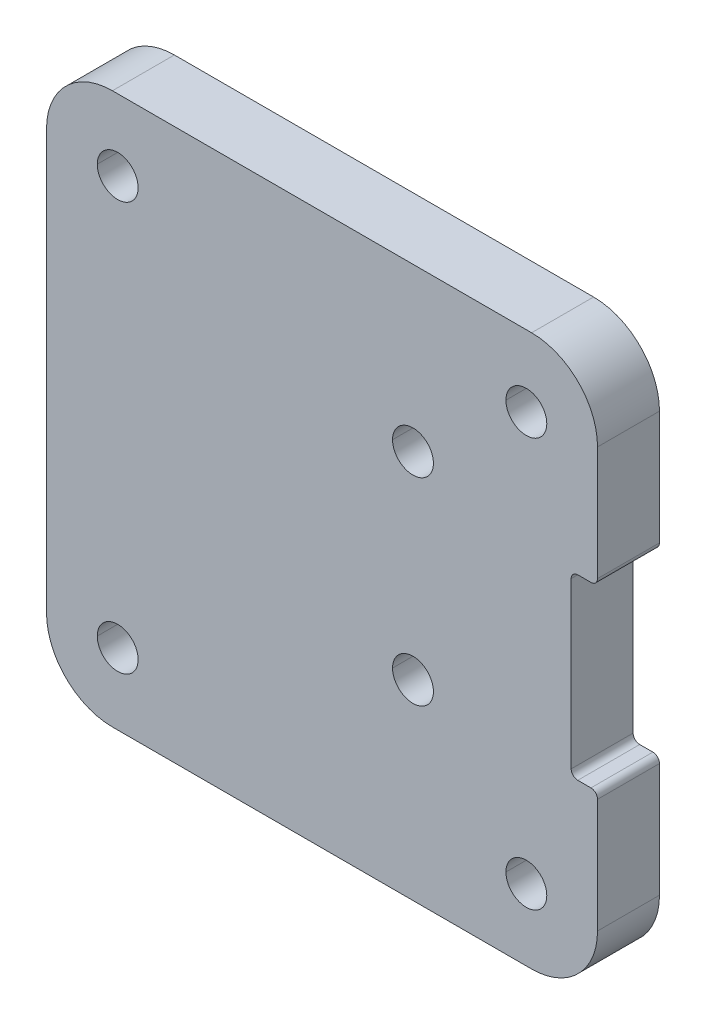
ISO-10303-21;
HEADER;
FILE_DESCRIPTION(('STEP AP214'),'2;1');
FILE_NAME('part.step','',(''),(''),'','','');
FILE_SCHEMA(('AUTOMOTIVE_DESIGN { 1 0 10303 214 1 1 1 1 }'));
ENDSEC;
DATA;
#1=APPLICATION_CONTEXT('core data for automotive mechanical design processes');
#2=APPLICATION_PROTOCOL_DEFINITION('international standard','automotive_design',2000,#1);
#3=PRODUCT_CONTEXT('',#1,'mechanical');
#4=PRODUCT('Part','Part','',(#3));
#5=PRODUCT_RELATED_PRODUCT_CATEGORY('part','',(#4));
#6=PRODUCT_DEFINITION_FORMATION('','',#4);
#7=PRODUCT_DEFINITION_CONTEXT('part definition',#1,'design');
#8=PRODUCT_DEFINITION('design','',#6,#7);
#9=PRODUCT_DEFINITION_SHAPE('','',#8);
#10=(LENGTH_UNIT() NAMED_UNIT(*) SI_UNIT(.MILLI.,.METRE.));
#11=(NAMED_UNIT(*) PLANE_ANGLE_UNIT() SI_UNIT($,.RADIAN.));
#12=(NAMED_UNIT(*) SI_UNIT($,.STERADIAN.) SOLID_ANGLE_UNIT());
#13=UNCERTAINTY_MEASURE_WITH_UNIT(LENGTH_MEASURE(1.E-05),#10,'distance_accuracy_value','');
#14=(GEOMETRIC_REPRESENTATION_CONTEXT(3) GLOBAL_UNCERTAINTY_ASSIGNED_CONTEXT((#13)) GLOBAL_UNIT_ASSIGNED_CONTEXT((#10,
#11,#12)) REPRESENTATION_CONTEXT('',''));
#15=CARTESIAN_POINT('',(0.,0.,0.));
#16=DIRECTION('',(0.,0.,1.));
#17=DIRECTION('',(1.,0.,0.));
#18=AXIS2_PLACEMENT_3D('',#15,#16,#17);
#19=CARTESIAN_POINT('',(20.4,7.25,4.7));
#20=DIRECTION('',(0.,0.,-1.));
#21=DIRECTION('',(-1.,0.,0.));
#22=AXIS2_PLACEMENT_3D('',#19,#20,#21);
#23=CYLINDRICAL_SURFACE('',#22,0.5);
#24=CARTESIAN_POINT('',(20.4,7.25,4.7));
#25=DIRECTION('',(0.,0.,1.));
#26=DIRECTION('',(-1.,0.,0.));
#27=AXIS2_PLACEMENT_3D('',#24,#25,#26);
#28=CIRCLE('',#27,0.5);
#29=CARTESIAN_POINT('',(20.4,6.75,4.7));
#30=VERTEX_POINT('',#29);
#31=CARTESIAN_POINT('',(20.9,7.25,4.7));
#32=VERTEX_POINT('',#31);
#33=EDGE_CURVE('E392',#30,#32,#28,.T.);
#34=ORIENTED_EDGE('',*,*,#33,.F.);
#35=DIRECTION('',(0.,0.,1.));
#36=VECTOR('',#35,1.);
#37=CARTESIAN_POINT('',(20.4,6.75,4.7));
#38=LINE('',#37,#36);
#39=CARTESIAN_POINT('',(20.4,6.75,0.));
#40=VERTEX_POINT('',#39);
#41=EDGE_CURVE('E495',#40,#30,#38,.T.);
#42=ORIENTED_EDGE('',*,*,#41,.F.);
#43=CARTESIAN_POINT('',(20.4,7.25,0.));
#44=DIRECTION('',(0.,0.,-1.));
#45=DIRECTION('',(-1.,0.,0.));
#46=AXIS2_PLACEMENT_3D('',#43,#44,#45);
#47=CIRCLE('',#46,0.5);
#48=CARTESIAN_POINT('',(20.9,7.25,0.));
#49=VERTEX_POINT('',#48);
#50=EDGE_CURVE('E405',#49,#40,#47,.T.);
#51=ORIENTED_EDGE('',*,*,#50,.F.);
#52=DIRECTION('',(0.,0.,-1.));
#53=VECTOR('',#52,1.);
#54=CARTESIAN_POINT('',(20.9,7.25,4.7));
#55=LINE('',#54,#53);
#56=EDGE_CURVE('E491',#32,#49,#55,.T.);
#57=ORIENTED_EDGE('',*,*,#56,.F.);
#58=EDGE_LOOP('',(#34,#42,#51,#57));
#59=FACE_BOUND('',#58,.T.);
#60=ADVANCED_FACE('F17',(#59),#23,.T.);
#61=CARTESIAN_POINT('',(19.4,6.25,4.7));
#62=DIRECTION('',(0.,0.,1.));
#63=DIRECTION('',(1.,0.,0.));
#64=AXIS2_PLACEMENT_3D('',#61,#62,#63);
#65=CYLINDRICAL_SURFACE('',#64,0.5);
#66=CARTESIAN_POINT('',(19.4,6.25,4.7));
#67=DIRECTION('',(0.,0.,-1.));
#68=DIRECTION('',(-1.,0.,0.));
#69=AXIS2_PLACEMENT_3D('',#66,#67,#68);
#70=CIRCLE('',#69,0.5);
#71=CARTESIAN_POINT('',(18.9,6.25,4.7));
#72=VERTEX_POINT('',#71);
#73=CARTESIAN_POINT('',(19.4,6.75,4.7));
#74=VERTEX_POINT('',#73);
#75=EDGE_CURVE('E384',#72,#74,#70,.T.);
#76=ORIENTED_EDGE('',*,*,#75,.F.);
#77=DIRECTION('',(0.,0.,1.));
#78=VECTOR('',#77,1.);
#79=CARTESIAN_POINT('',(18.9,6.25,4.7));
#80=LINE('',#79,#78);
#81=CARTESIAN_POINT('',(18.9,6.25,0.));
#82=VERTEX_POINT('',#81);
#83=EDGE_CURVE('E50',#82,#72,#80,.T.);
#84=ORIENTED_EDGE('',*,*,#83,.F.);
#85=CARTESIAN_POINT('',(19.4,6.25,0.));
#86=DIRECTION('',(0.,0.,1.));
#87=DIRECTION('',(-1.,0.,0.));
#88=AXIS2_PLACEMENT_3D('',#85,#86,#87);
#89=CIRCLE('',#88,0.5);
#90=CARTESIAN_POINT('',(19.4,6.75,0.));
#91=VERTEX_POINT('',#90);
#92=EDGE_CURVE('E503',#91,#82,#89,.T.);
#93=ORIENTED_EDGE('',*,*,#92,.F.);
#94=DIRECTION('',(0.,0.,-1.));
#95=VECTOR('',#94,1.);
#96=CARTESIAN_POINT('',(19.4,6.75,0.));
#97=LINE('',#96,#95);
#98=EDGE_CURVE('E524',#74,#91,#97,.T.);
#99=ORIENTED_EDGE('',*,*,#98,.F.);
#100=EDGE_LOOP('',(#76,#84,#93,#99));
#101=FACE_BOUND('',#100,.T.);
#102=ADVANCED_FACE('F568',(#101),#65,.F.);
#103=CARTESIAN_POINT('',(19.4,-6.25,4.7));
#104=DIRECTION('',(0.,0.,1.));
#105=DIRECTION('',(1.,0.,0.));
#106=AXIS2_PLACEMENT_3D('',#103,#104,#105);
#107=CYLINDRICAL_SURFACE('',#106,0.5);
#108=CARTESIAN_POINT('',(19.4,-6.25,4.7));
#109=DIRECTION('',(0.,0.,-1.));
#110=DIRECTION('',(-1.,0.,0.));
#111=AXIS2_PLACEMENT_3D('',#108,#109,#110);
#112=CIRCLE('',#111,0.5);
#113=CARTESIAN_POINT('',(19.4,-6.75,4.7));
#114=VERTEX_POINT('',#113);
#115=CARTESIAN_POINT('',(18.9,-6.25,4.7));
#116=VERTEX_POINT('',#115);
#117=EDGE_CURVE('E367',#114,#116,#112,.T.);
#118=ORIENTED_EDGE('',*,*,#117,.F.);
#119=DIRECTION('',(0.,0.,1.));
#120=VECTOR('',#119,1.);
#121=CARTESIAN_POINT('',(19.4,-6.75,4.7));
#122=LINE('',#121,#120);
#123=CARTESIAN_POINT('',(19.4,-6.75,0.));
#124=VERTEX_POINT('',#123);
#125=EDGE_CURVE('E482',#124,#114,#122,.T.);
#126=ORIENTED_EDGE('',*,*,#125,.F.);
#127=CARTESIAN_POINT('',(19.4,-6.25,0.));
#128=DIRECTION('',(0.,0.,1.));
#129=DIRECTION('',(-1.,0.,0.));
#130=AXIS2_PLACEMENT_3D('',#127,#128,#129);
#131=CIRCLE('',#130,0.5);
#132=CARTESIAN_POINT('',(18.9,-6.25,0.));
#133=VERTEX_POINT('',#132);
#134=EDGE_CURVE('E465',#133,#124,#131,.T.);
#135=ORIENTED_EDGE('',*,*,#134,.F.);
#136=DIRECTION('',(0.,0.,-1.));
#137=VECTOR('',#136,1.);
#138=CARTESIAN_POINT('',(18.9,-6.25,0.));
#139=LINE('',#138,#137);
#140=EDGE_CURVE('E39',#116,#133,#139,.T.);
#141=ORIENTED_EDGE('',*,*,#140,.F.);
#142=EDGE_LOOP('',(#118,#126,#135,#141));
#143=FACE_BOUND('',#142,.T.);
#144=ADVANCED_FACE('F570',(#143),#107,.F.);
#145=CARTESIAN_POINT('',(20.4,-7.25,4.7));
#146=DIRECTION('',(0.,0.,-1.));
#147=DIRECTION('',(-1.,0.,0.));
#148=AXIS2_PLACEMENT_3D('',#145,#146,#147);
#149=CYLINDRICAL_SURFACE('',#148,0.5);
#150=CARTESIAN_POINT('',(20.4,-7.25,4.7));
#151=DIRECTION('',(0.,0.,1.));
#152=DIRECTION('',(-1.,0.,0.));
#153=AXIS2_PLACEMENT_3D('',#150,#151,#152);
#154=CIRCLE('',#153,0.5);
#155=CARTESIAN_POINT('',(20.9,-7.25,4.7));
#156=VERTEX_POINT('',#155);
#157=CARTESIAN_POINT('',(20.4,-6.75,4.7));
#158=VERTEX_POINT('',#157);
#159=EDGE_CURVE('E362',#156,#158,#154,.T.);
#160=ORIENTED_EDGE('',*,*,#159,.F.);
#161=DIRECTION('',(0.,0.,1.));
#162=VECTOR('',#161,1.);
#163=CARTESIAN_POINT('',(20.9,-7.25,4.7));
#164=LINE('',#163,#162);
#165=CARTESIAN_POINT('',(20.9,-7.25,0.));
#166=VERTEX_POINT('',#165);
#167=EDGE_CURVE('E517',#166,#156,#164,.T.);
#168=ORIENTED_EDGE('',*,*,#167,.F.);
#169=CARTESIAN_POINT('',(20.4,-7.25,0.));
#170=DIRECTION('',(0.,0.,-1.));
#171=DIRECTION('',(-1.,0.,0.));
#172=AXIS2_PLACEMENT_3D('',#169,#170,#171);
#173=CIRCLE('',#172,0.5);
#174=CARTESIAN_POINT('',(20.4,-6.75,0.));
#175=VERTEX_POINT('',#174);
#176=EDGE_CURVE('E460',#175,#166,#173,.T.);
#177=ORIENTED_EDGE('',*,*,#176,.F.);
#178=DIRECTION('',(0.,0.,-1.));
#179=VECTOR('',#178,1.);
#180=CARTESIAN_POINT('',(20.4,-6.75,4.7));
#181=LINE('',#180,#179);
#182=EDGE_CURVE('E523',#158,#175,#181,.T.);
#183=ORIENTED_EDGE('',*,*,#182,.F.);
#184=EDGE_LOOP('',(#160,#168,#177,#183));
#185=FACE_BOUND('',#184,.T.);
#186=ADVANCED_FACE('F576',(#185),#149,.T.);
#187=CARTESIAN_POINT('',(-15.9,15.9,4.7));
#188=DIRECTION('',(0.,0.,-1.));
#189=DIRECTION('',(-1.,0.,0.));
#190=AXIS2_PLACEMENT_3D('',#187,#188,#189);
#191=CYLINDRICAL_SURFACE('',#190,5.);
#192=CARTESIAN_POINT('',(-15.9,15.9,4.7));
#193=DIRECTION('',(0.,0.,1.));
#194=DIRECTION('',(-1.,0.,0.));
#195=AXIS2_PLACEMENT_3D('',#192,#193,#194);
#196=CIRCLE('',#195,5.);
#197=CARTESIAN_POINT('',(-15.9,20.9,4.7));
#198=VERTEX_POINT('',#197);
#199=CARTESIAN_POINT('',(-20.9,15.9,4.7));
#200=VERTEX_POINT('',#199);
#201=EDGE_CURVE('E349',#198,#200,#196,.T.);
#202=ORIENTED_EDGE('',*,*,#201,.F.);
#203=DIRECTION('',(0.,0.,1.));
#204=VECTOR('',#203,1.);
#205=CARTESIAN_POINT('',(-15.9,20.9,4.7));
#206=LINE('',#205,#204);
#207=CARTESIAN_POINT('',(-15.9,20.9,0.));
#208=VERTEX_POINT('',#207);
#209=EDGE_CURVE('E11',#208,#198,#206,.T.);
#210=ORIENTED_EDGE('',*,*,#209,.F.);
#211=CARTESIAN_POINT('',(-15.9,15.9,0.));
#212=DIRECTION('',(0.,0.,-1.));
#213=DIRECTION('',(-1.,0.,0.));
#214=AXIS2_PLACEMENT_3D('',#211,#212,#213);
#215=CIRCLE('',#214,5.);
#216=CARTESIAN_POINT('',(-20.9,15.9,0.));
#217=VERTEX_POINT('',#216);
#218=EDGE_CURVE('E379',#217,#208,#215,.T.);
#219=ORIENTED_EDGE('',*,*,#218,.F.);
#220=DIRECTION('',(0.,0.,-1.));
#221=VECTOR('',#220,1.);
#222=CARTESIAN_POINT('',(-20.9,15.9,4.7));
#223=LINE('',#222,#221);
#224=EDGE_CURVE('E308',#200,#217,#223,.T.);
#225=ORIENTED_EDGE('',*,*,#224,.F.);
#226=EDGE_LOOP('',(#202,#210,#219,#225));
#227=FACE_BOUND('',#226,.T.);
#228=ADVANCED_FACE('F555',(#227),#191,.T.);
#229=CARTESIAN_POINT('',(15.9,15.9,4.7));
#230=DIRECTION('',(0.,0.,-1.));
#231=DIRECTION('',(-1.,0.,0.));
#232=AXIS2_PLACEMENT_3D('',#229,#230,#231);
#233=CYLINDRICAL_SURFACE('',#232,5.);
#234=CARTESIAN_POINT('',(15.9,15.9,4.7));
#235=DIRECTION('',(0.,0.,1.));
#236=DIRECTION('',(-1.,0.,0.));
#237=AXIS2_PLACEMENT_3D('',#234,#235,#236);
#238=CIRCLE('',#237,5.);
#239=CARTESIAN_POINT('',(20.9,15.9,4.7));
#240=VERTEX_POINT('',#239);
#241=CARTESIAN_POINT('',(15.9,20.9,4.7));
#242=VERTEX_POINT('',#241);
#243=EDGE_CURVE('E413',#240,#242,#238,.T.);
#244=ORIENTED_EDGE('',*,*,#243,.F.);
#245=DIRECTION('',(0.,0.,1.));
#246=VECTOR('',#245,1.);
#247=CARTESIAN_POINT('',(20.9,15.9,4.7));
#248=LINE('',#247,#246);
#249=CARTESIAN_POINT('',(20.9,15.9,0.));
#250=VERTEX_POINT('',#249);
#251=EDGE_CURVE('E494',#250,#240,#248,.T.);
#252=ORIENTED_EDGE('',*,*,#251,.F.);
#253=CARTESIAN_POINT('',(15.9,15.9,0.));
#254=DIRECTION('',(0.,0.,-1.));
#255=DIRECTION('',(-1.,0.,0.));
#256=AXIS2_PLACEMENT_3D('',#253,#254,#255);
#257=CIRCLE('',#256,5.);
#258=CARTESIAN_POINT('',(15.9,20.9,0.));
#259=VERTEX_POINT('',#258);
#260=EDGE_CURVE('E406',#259,#250,#257,.T.);
#261=ORIENTED_EDGE('',*,*,#260,.F.);
#262=DIRECTION('',(0.,0.,-1.));
#263=VECTOR('',#262,1.);
#264=CARTESIAN_POINT('',(15.9,20.9,4.7));
#265=LINE('',#264,#263);
#266=EDGE_CURVE('E20',#242,#259,#265,.T.);
#267=ORIENTED_EDGE('',*,*,#266,.F.);
#268=EDGE_LOOP('',(#244,#252,#261,#267));
#269=FACE_BOUND('',#268,.T.);
#270=ADVANCED_FACE('F547',(#269),#233,.T.);
#271=CARTESIAN_POINT('',(15.9,-15.9,4.7));
#272=DIRECTION('',(0.,0.,-1.));
#273=DIRECTION('',(-1.,0.,0.));
#274=AXIS2_PLACEMENT_3D('',#271,#272,#273);
#275=CYLINDRICAL_SURFACE('',#274,5.);
#276=CARTESIAN_POINT('',(15.9,-15.9,4.7));
#277=DIRECTION('',(0.,0.,1.));
#278=DIRECTION('',(-1.,0.,0.));
#279=AXIS2_PLACEMENT_3D('',#276,#277,#278);
#280=CIRCLE('',#279,5.);
#281=CARTESIAN_POINT('',(15.9,-20.9,4.7));
#282=VERTEX_POINT('',#281);
#283=CARTESIAN_POINT('',(20.9,-15.9,4.7));
#284=VERTEX_POINT('',#283);
#285=EDGE_CURVE('E409',#282,#284,#280,.T.);
#286=ORIENTED_EDGE('',*,*,#285,.F.);
#287=DIRECTION('',(0.,0.,1.));
#288=VECTOR('',#287,1.);
#289=CARTESIAN_POINT('',(15.9,-20.9,4.7));
#290=LINE('',#289,#288);
#291=CARTESIAN_POINT('',(15.9,-20.9,0.));
#292=VERTEX_POINT('',#291);
#293=EDGE_CURVE('E307',#292,#282,#290,.T.);
#294=ORIENTED_EDGE('',*,*,#293,.F.);
#295=CARTESIAN_POINT('',(15.9,-15.9,0.));
#296=DIRECTION('',(0.,0.,-1.));
#297=DIRECTION('',(-1.,0.,0.));
#298=AXIS2_PLACEMENT_3D('',#295,#296,#297);
#299=CIRCLE('',#298,5.);
#300=CARTESIAN_POINT('',(20.9,-15.9,0.));
#301=VERTEX_POINT('',#300);
#302=EDGE_CURVE('E473',#301,#292,#299,.T.);
#303=ORIENTED_EDGE('',*,*,#302,.F.);
#304=DIRECTION('',(0.,0.,-1.));
#305=VECTOR('',#304,1.);
#306=CARTESIAN_POINT('',(20.9,-15.9,4.7));
#307=LINE('',#306,#305);
#308=EDGE_CURVE('E520',#284,#301,#307,.T.);
#309=ORIENTED_EDGE('',*,*,#308,.F.);
#310=EDGE_LOOP('',(#286,#294,#303,#309));
#311=FACE_BOUND('',#310,.T.);
#312=ADVANCED_FACE('F584',(#311),#275,.T.);
#313=CARTESIAN_POINT('',(-15.9,-15.9,4.7));
#314=DIRECTION('',(0.,0.,-1.));
#315=DIRECTION('',(-1.,0.,0.));
#316=AXIS2_PLACEMENT_3D('',#313,#314,#315);
#317=CYLINDRICAL_SURFACE('',#316,5.);
#318=CARTESIAN_POINT('',(-15.9,-15.9,4.7));
#319=DIRECTION('',(0.,0.,1.));
#320=DIRECTION('',(-1.,0.,0.));
#321=AXIS2_PLACEMENT_3D('',#318,#319,#320);
#322=CIRCLE('',#321,5.);
#323=CARTESIAN_POINT('',(-20.9,-15.9,4.7));
#324=VERTEX_POINT('',#323);
#325=CARTESIAN_POINT('',(-15.9,-20.9,4.7));
#326=VERTEX_POINT('',#325);
#327=EDGE_CURVE('E435',#324,#326,#322,.T.);
#328=ORIENTED_EDGE('',*,*,#327,.F.);
#329=DIRECTION('',(0.,0.,1.));
#330=VECTOR('',#329,1.);
#331=CARTESIAN_POINT('',(-20.9,-15.9,4.7));
#332=LINE('',#331,#330);
#333=CARTESIAN_POINT('',(-20.9,-15.9,0.));
#334=VERTEX_POINT('',#333);
#335=EDGE_CURVE('E325',#334,#324,#332,.T.);
#336=ORIENTED_EDGE('',*,*,#335,.F.);
#337=CARTESIAN_POINT('',(-15.9,-15.9,0.));
#338=DIRECTION('',(0.,0.,-1.));
#339=DIRECTION('',(-1.,0.,0.));
#340=AXIS2_PLACEMENT_3D('',#337,#338,#339);
#341=CIRCLE('',#340,5.);
#342=CARTESIAN_POINT('',(-15.9,-20.9,0.));
#343=VERTEX_POINT('',#342);
#344=EDGE_CURVE('E380',#343,#334,#341,.T.);
#345=ORIENTED_EDGE('',*,*,#344,.F.);
#346=DIRECTION('',(0.,0.,-1.));
#347=VECTOR('',#346,1.);
#348=CARTESIAN_POINT('',(-15.9,-20.9,4.7));
#349=LINE('',#348,#347);
#350=EDGE_CURVE('E304',#326,#343,#349,.T.);
#351=ORIENTED_EDGE('',*,*,#350,.F.);
#352=EDGE_LOOP('',(#328,#336,#345,#351));
#353=FACE_BOUND('',#352,.T.);
#354=ADVANCED_FACE('F589',(#353),#317,.T.);
#355=CARTESIAN_POINT('',(6.90000000000016,-6.4,4.7));
#356=DIRECTION('',(0.,0.,-1.));
#357=DIRECTION('',(-1.,0.,0.));
#358=AXIS2_PLACEMENT_3D('',#355,#356,#357);
#359=CYLINDRICAL_SURFACE('',#358,1.55);
#360=DIRECTION('',(0.,0.,-1.));
#361=VECTOR('',#360,1.);
#362=CARTESIAN_POINT('',(8.45000000000016,-6.4,4.7));
#363=LINE('',#362,#361);
#364=CARTESIAN_POINT('',(8.45000000000016,-6.4,4.7));
#365=VERTEX_POINT('',#364);
#366=CARTESIAN_POINT('',(8.45000000000016,-6.4,0.));
#367=VERTEX_POINT('',#366);
#368=EDGE_CURVE('E678',#365,#367,#363,.T.);
#369=ORIENTED_EDGE('',*,*,#368,.F.);
#370=CARTESIAN_POINT('',(6.90000000000016,-6.4,4.7));
#371=DIRECTION('',(0.,0.,1.));
#372=DIRECTION('',(1.,0.,0.));
#373=AXIS2_PLACEMENT_3D('',#370,#371,#372);
#374=CIRCLE('',#373,1.55);
#375=CARTESIAN_POINT('',(5.35000000000016,-6.4,4.7));
#376=VERTEX_POINT('',#375);
#377=EDGE_CURVE('E421',#365,#376,#374,.T.);
#378=ORIENTED_EDGE('',*,*,#377,.T.);
#379=DIRECTION('',(0.,0.,-1.));
#380=VECTOR('',#379,1.);
#381=CARTESIAN_POINT('',(5.35000000000016,-6.4,4.7));
#382=LINE('',#381,#380);
#383=CARTESIAN_POINT('',(5.35000000000016,-6.4,0.));
#384=VERTEX_POINT('',#383);
#385=EDGE_CURVE('E680',#376,#384,#382,.T.);
#386=ORIENTED_EDGE('',*,*,#385,.T.);
#387=CARTESIAN_POINT('',(6.90000000000016,-6.4,0.));
#388=DIRECTION('',(0.,0.,1.));
#389=DIRECTION('',(1.,0.,0.));
#390=AXIS2_PLACEMENT_3D('',#387,#388,#389);
#391=CIRCLE('',#390,1.55);
#392=EDGE_CURVE('E322',#367,#384,#391,.T.);
#393=ORIENTED_EDGE('',*,*,#392,.F.);
#394=EDGE_LOOP('',(#369,#378,#386,#393));
#395=FACE_BOUND('',#394,.T.);
#396=ADVANCED_FACE('F585',(#395),#359,.F.);
#397=CARTESIAN_POINT('',(6.9,8.6,4.7));
#398=DIRECTION('',(0.,0.,-1.));
#399=DIRECTION('',(-1.,0.,0.));
#400=AXIS2_PLACEMENT_3D('',#397,#398,#399);
#401=CYLINDRICAL_SURFACE('',#400,1.55);
#402=DIRECTION('',(0.,0.,-1.));
#403=VECTOR('',#402,1.);
#404=CARTESIAN_POINT('',(8.45,8.6,4.7));
#405=LINE('',#404,#403);
#406=CARTESIAN_POINT('',(8.45,8.6,4.7));
#407=VERTEX_POINT('',#406);
#408=CARTESIAN_POINT('',(8.45,8.6,0.));
#409=VERTEX_POINT('',#408);
#410=EDGE_CURVE('E703',#407,#409,#405,.T.);
#411=ORIENTED_EDGE('',*,*,#410,.F.);
#412=CARTESIAN_POINT('',(6.9,8.6,4.7));
#413=DIRECTION('',(0.,0.,1.));
#414=DIRECTION('',(1.,0.,0.));
#415=AXIS2_PLACEMENT_3D('',#412,#413,#414);
#416=CIRCLE('',#415,1.55);
#417=CARTESIAN_POINT('',(5.35,8.6,4.7));
#418=VERTEX_POINT('',#417);
#419=EDGE_CURVE('E425',#407,#418,#416,.T.);
#420=ORIENTED_EDGE('',*,*,#419,.T.);
#421=DIRECTION('',(0.,0.,-1.));
#422=VECTOR('',#421,1.);
#423=CARTESIAN_POINT('',(5.35,8.6,4.7));
#424=LINE('',#423,#422);
#425=CARTESIAN_POINT('',(5.35,8.6,0.));
#426=VERTEX_POINT('',#425);
#427=EDGE_CURVE('E695',#418,#426,#424,.T.);
#428=ORIENTED_EDGE('',*,*,#427,.T.);
#429=CARTESIAN_POINT('',(6.9,8.6,0.));
#430=DIRECTION('',(0.,0.,1.));
#431=DIRECTION('',(1.,0.,0.));
#432=AXIS2_PLACEMENT_3D('',#429,#430,#431);
#433=CIRCLE('',#432,1.55);
#434=EDGE_CURVE('E278',#409,#426,#433,.T.);
#435=ORIENTED_EDGE('',*,*,#434,.F.);
#436=EDGE_LOOP('',(#411,#420,#428,#435));
#437=FACE_BOUND('',#436,.T.);
#438=ADVANCED_FACE('F588',(#437),#401,.F.);
#439=CARTESIAN_POINT('',(-15.5000000000004,-15.5,4.7));
#440=DIRECTION('',(0.,0.,-1.));
#441=DIRECTION('',(-1.,0.,0.));
#442=AXIS2_PLACEMENT_3D('',#439,#440,#441);
#443=CYLINDRICAL_SURFACE('',#442,1.55);
#444=DIRECTION('',(0.,0.,-1.));
#445=VECTOR('',#444,1.);
#446=CARTESIAN_POINT('',(-13.9500000000004,-15.5,4.7));
#447=LINE('',#446,#445);
#448=CARTESIAN_POINT('',(-13.9500000000004,-15.5,4.7));
#449=VERTEX_POINT('',#448);
#450=CARTESIAN_POINT('',(-13.9500000000004,-15.5,0.));
#451=VERTEX_POINT('',#450);
#452=EDGE_CURVE('E692',#449,#451,#447,.T.);
#453=ORIENTED_EDGE('',*,*,#452,.F.);
#454=CARTESIAN_POINT('',(-15.5000000000004,-15.5,4.7));
#455=DIRECTION('',(0.,0.,1.));
#456=DIRECTION('',(-1.,0.,0.));
#457=AXIS2_PLACEMENT_3D('',#454,#455,#456);
#458=CIRCLE('',#457,1.55);
#459=CARTESIAN_POINT('',(-17.0500000000005,-15.5,4.7));
#460=VERTEX_POINT('',#459);
#461=EDGE_CURVE('E448',#449,#460,#458,.T.);
#462=ORIENTED_EDGE('',*,*,#461,.T.);
#463=DIRECTION('',(0.,0.,-1.));
#464=VECTOR('',#463,1.);
#465=CARTESIAN_POINT('',(-17.0500000000005,-15.5,4.7));
#466=LINE('',#465,#464);
#467=CARTESIAN_POINT('',(-17.0500000000005,-15.5,0.));
#468=VERTEX_POINT('',#467);
#469=EDGE_CURVE('E309',#460,#468,#466,.T.);
#470=ORIENTED_EDGE('',*,*,#469,.T.);
#471=CARTESIAN_POINT('',(-15.5000000000004,-15.5,0.));
#472=DIRECTION('',(0.,0.,1.));
#473=DIRECTION('',(-1.,0.,0.));
#474=AXIS2_PLACEMENT_3D('',#471,#472,#473);
#475=CIRCLE('',#474,1.55);
#476=EDGE_CURVE('E326',#451,#468,#475,.T.);
#477=ORIENTED_EDGE('',*,*,#476,.F.);
#478=EDGE_LOOP('',(#453,#462,#470,#477));
#479=FACE_BOUND('',#478,.T.);
#480=ADVANCED_FACE('F593',(#479),#443,.F.);
#481=CARTESIAN_POINT('',(15.4999999999994,-15.4999999999995,4.7));
#482=DIRECTION('',(0.,0.,-1.));
#483=DIRECTION('',(-1.,0.,0.));
#484=AXIS2_PLACEMENT_3D('',#481,#482,#483);
#485=CYLINDRICAL_SURFACE('',#484,1.55);
#486=DIRECTION('',(0.,0.,-1.));
#487=VECTOR('',#486,1.);
#488=CARTESIAN_POINT('',(17.0499999999994,-15.4999999999995,4.7));
#489=LINE('',#488,#487);
#490=CARTESIAN_POINT('',(17.0499999999994,-15.4999999999995,4.7));
#491=VERTEX_POINT('',#490);
#492=CARTESIAN_POINT('',(17.0499999999994,-15.4999999999995,0.));
#493=VERTEX_POINT('',#492);
#494=EDGE_CURVE('E291',#491,#493,#489,.T.);
#495=ORIENTED_EDGE('',*,*,#494,.F.);
#496=CARTESIAN_POINT('',(15.4999999999994,-15.4999999999995,4.7));
#497=DIRECTION('',(0.,0.,1.));
#498=DIRECTION('',(1.,0.,0.));
#499=AXIS2_PLACEMENT_3D('',#496,#497,#498);
#500=CIRCLE('',#499,1.55);
#501=CARTESIAN_POINT('',(13.9499999999994,-15.4999999999995,4.7));
#502=VERTEX_POINT('',#501);
#503=EDGE_CURVE('E283',#491,#502,#500,.T.);
#504=ORIENTED_EDGE('',*,*,#503,.T.);
#505=DIRECTION('',(0.,0.,-1.));
#506=VECTOR('',#505,1.);
#507=CARTESIAN_POINT('',(13.9499999999994,-15.4999999999995,4.7));
#508=LINE('',#507,#506);
#509=CARTESIAN_POINT('',(13.9499999999994,-15.4999999999995,0.));
#510=VERTEX_POINT('',#509);
#511=EDGE_CURVE('E281',#502,#510,#508,.T.);
#512=ORIENTED_EDGE('',*,*,#511,.T.);
#513=CARTESIAN_POINT('',(15.4999999999994,-15.4999999999995,0.));
#514=DIRECTION('',(0.,0.,1.));
#515=DIRECTION('',(1.,0.,0.));
#516=AXIS2_PLACEMENT_3D('',#513,#514,#515);
#517=CIRCLE('',#516,1.55);
#518=EDGE_CURVE('E267',#493,#510,#517,.T.);
#519=ORIENTED_EDGE('',*,*,#518,.F.);
#520=EDGE_LOOP('',(#495,#504,#512,#519));
#521=FACE_BOUND('',#520,.T.);
#522=ADVANCED_FACE('F282',(#521),#485,.F.);
#523=CARTESIAN_POINT('',(15.5,15.4999999999995,4.7));
#524=DIRECTION('',(0.,0.,-1.));
#525=DIRECTION('',(-1.,0.,0.));
#526=AXIS2_PLACEMENT_3D('',#523,#524,#525);
#527=CYLINDRICAL_SURFACE('',#526,1.55);
#528=DIRECTION('',(0.,0.,-1.));
#529=VECTOR('',#528,1.);
#530=CARTESIAN_POINT('',(17.05,15.4999999999995,4.7));
#531=LINE('',#530,#529);
#532=CARTESIAN_POINT('',(17.05,15.4999999999995,4.7));
#533=VERTEX_POINT('',#532);
#534=CARTESIAN_POINT('',(17.05,15.4999999999995,0.));
#535=VERTEX_POINT('',#534);
#536=EDGE_CURVE('E330',#533,#535,#531,.T.);
#537=ORIENTED_EDGE('',*,*,#536,.F.);
#538=CARTESIAN_POINT('',(15.5,15.4999999999995,4.7));
#539=DIRECTION('',(0.,0.,1.));
#540=DIRECTION('',(-1.,0.,0.));
#541=AXIS2_PLACEMENT_3D('',#538,#539,#540);
#542=CIRCLE('',#541,1.55);
#543=CARTESIAN_POINT('',(13.95,15.4999999999995,4.7));
#544=VERTEX_POINT('',#543);
#545=EDGE_CURVE('E393',#533,#544,#542,.T.);
#546=ORIENTED_EDGE('',*,*,#545,.T.);
#547=DIRECTION('',(0.,0.,-1.));
#548=VECTOR('',#547,1.);
#549=CARTESIAN_POINT('',(13.95,15.4999999999995,4.7));
#550=LINE('',#549,#548);
#551=CARTESIAN_POINT('',(13.95,15.4999999999995,0.));
#552=VERTEX_POINT('',#551);
#553=EDGE_CURVE('E338',#544,#552,#550,.T.);
#554=ORIENTED_EDGE('',*,*,#553,.T.);
#555=CARTESIAN_POINT('',(15.5,15.4999999999995,0.));
#556=DIRECTION('',(0.,0.,1.));
#557=DIRECTION('',(-1.,0.,0.));
#558=AXIS2_PLACEMENT_3D('',#555,#556,#557);
#559=CIRCLE('',#558,1.55);
#560=EDGE_CURVE('E431',#535,#552,#559,.T.);
#561=ORIENTED_EDGE('',*,*,#560,.F.);
#562=EDGE_LOOP('',(#537,#546,#554,#561));
#563=FACE_BOUND('',#562,.T.);
#564=ADVANCED_FACE('F600',(#563),#527,.F.);
#565=CARTESIAN_POINT('',(-15.5,15.5,4.7));
#566=DIRECTION('',(0.,0.,-1.));
#567=DIRECTION('',(-1.,0.,0.));
#568=AXIS2_PLACEMENT_3D('',#565,#566,#567);
#569=CYLINDRICAL_SURFACE('',#568,1.55);
#570=DIRECTION('',(0.,0.,-1.));
#571=VECTOR('',#570,1.);
#572=CARTESIAN_POINT('',(-13.95,15.5,4.7));
#573=LINE('',#572,#571);
#574=CARTESIAN_POINT('',(-13.95,15.5,4.7));
#575=VERTEX_POINT('',#574);
#576=CARTESIAN_POINT('',(-13.95,15.5,0.));
#577=VERTEX_POINT('',#576);
#578=EDGE_CURVE('E320',#575,#577,#573,.T.);
#579=ORIENTED_EDGE('',*,*,#578,.F.);
#580=CARTESIAN_POINT('',(-15.5,15.5,4.7));
#581=DIRECTION('',(0.,0.,1.));
#582=DIRECTION('',(1.,0.,0.));
#583=AXIS2_PLACEMENT_3D('',#580,#581,#582);
#584=CIRCLE('',#583,1.55);
#585=CARTESIAN_POINT('',(-17.05,15.5,4.7));
#586=VERTEX_POINT('',#585);
#587=EDGE_CURVE('E396',#575,#586,#584,.T.);
#588=ORIENTED_EDGE('',*,*,#587,.T.);
#589=DIRECTION('',(0.,0.,-1.));
#590=VECTOR('',#589,1.);
#591=CARTESIAN_POINT('',(-17.05,15.5,4.7));
#592=LINE('',#591,#590);
#593=CARTESIAN_POINT('',(-17.05,15.5,0.));
#594=VERTEX_POINT('',#593);
#595=EDGE_CURVE('E319',#586,#594,#592,.T.);
#596=ORIENTED_EDGE('',*,*,#595,.T.);
#597=CARTESIAN_POINT('',(-15.5,15.5,0.));
#598=DIRECTION('',(0.,0.,1.));
#599=DIRECTION('',(1.,0.,0.));
#600=AXIS2_PLACEMENT_3D('',#597,#598,#599);
#601=CIRCLE('',#600,1.55);
#602=EDGE_CURVE('E277',#577,#594,#601,.T.);
#603=ORIENTED_EDGE('',*,*,#602,.F.);
#604=EDGE_LOOP('',(#579,#588,#596,#603));
#605=FACE_BOUND('',#604,.T.);
#606=ADVANCED_FACE('F603',(#605),#569,.F.);
#607=CARTESIAN_POINT('',(20.9,20.9,4.7));
#608=DIRECTION('',(0.,-1.,0.));
#609=DIRECTION('',(0.,0.,-1.));
#610=AXIS2_PLACEMENT_3D('',#607,#608,#609);
#611=PLANE('',#610);
#612=DIRECTION('',(-1.,0.,0.));
#613=VECTOR('',#612,1.);
#614=CARTESIAN_POINT('',(20.9,20.9,4.7));
#615=LINE('',#614,#613);
#616=EDGE_CURVE('E354',#242,#198,#615,.T.);
#617=ORIENTED_EDGE('',*,*,#616,.F.);
#618=ORIENTED_EDGE('',*,*,#266,.T.);
#619=DIRECTION('',(-1.,0.,0.));
#620=VECTOR('',#619,1.);
#621=CARTESIAN_POINT('',(20.9,20.9,0.));
#622=LINE('',#621,#620);
#623=EDGE_CURVE('E420',#259,#208,#622,.T.);
#624=ORIENTED_EDGE('',*,*,#623,.T.);
#625=ORIENTED_EDGE('',*,*,#209,.T.);
#626=EDGE_LOOP('',(#617,#618,#624,#625));
#627=FACE_BOUND('',#626,.T.);
#628=ADVANCED_FACE('F544',(#627),#611,.F.);
#629=CARTESIAN_POINT('',(20.9,20.9,4.7));
#630=DIRECTION('',(-1.,0.,0.));
#631=DIRECTION('',(0.,1.,0.));
#632=AXIS2_PLACEMENT_3D('',#629,#630,#631);
#633=PLANE('',#632);
#634=DIRECTION('',(0.,1.,0.));
#635=VECTOR('',#634,1.);
#636=CARTESIAN_POINT('',(20.9,20.9,4.7));
#637=LINE('',#636,#635);
#638=EDGE_CURVE('E400',#32,#240,#637,.T.);
#639=ORIENTED_EDGE('',*,*,#638,.F.);
#640=ORIENTED_EDGE('',*,*,#56,.T.);
#641=DIRECTION('',(0.,1.,0.));
#642=VECTOR('',#641,1.);
#643=CARTESIAN_POINT('',(20.9,20.9,0.));
#644=LINE('',#643,#642);
#645=EDGE_CURVE('E401',#49,#250,#644,.T.);
#646=ORIENTED_EDGE('',*,*,#645,.T.);
#647=ORIENTED_EDGE('',*,*,#251,.T.);
#648=EDGE_LOOP('',(#639,#640,#646,#647));
#649=FACE_BOUND('',#648,.T.);
#650=ADVANCED_FACE('F560',(#649),#633,.F.);
#651=CARTESIAN_POINT('',(20.9,6.75,4.7));
#652=DIRECTION('',(0.,1.,0.));
#653=DIRECTION('',(1.,0.,0.));
#654=AXIS2_PLACEMENT_3D('',#651,#652,#653);
#655=PLANE('',#654);
#656=DIRECTION('',(1.,0.,0.));
#657=VECTOR('',#656,1.);
#658=CARTESIAN_POINT('',(20.9,6.75,4.7));
#659=LINE('',#658,#657);
#660=EDGE_CURVE('E388',#74,#30,#659,.T.);
#661=ORIENTED_EDGE('',*,*,#660,.F.);
#662=ORIENTED_EDGE('',*,*,#98,.T.);
#663=DIRECTION('',(1.,0.,0.));
#664=VECTOR('',#663,1.);
#665=CARTESIAN_POINT('',(20.9,6.75,0.));
#666=LINE('',#665,#664);
#667=EDGE_CURVE('E499',#91,#40,#666,.T.);
#668=ORIENTED_EDGE('',*,*,#667,.T.);
#669=ORIENTED_EDGE('',*,*,#41,.T.);
#670=EDGE_LOOP('',(#661,#662,#668,#669));
#671=FACE_BOUND('',#670,.T.);
#672=ADVANCED_FACE('F567',(#671),#655,.F.);
#673=CARTESIAN_POINT('',(18.9,6.75,4.7));
#674=DIRECTION('',(-1.,0.,0.));
#675=DIRECTION('',(0.,0.,1.));
#676=AXIS2_PLACEMENT_3D('',#673,#674,#675);
#677=PLANE('',#676);
#678=DIRECTION('',(0.,1.,0.));
#679=VECTOR('',#678,1.);
#680=CARTESIAN_POINT('',(18.9,6.75,4.7));
#681=LINE('',#680,#679);
#682=EDGE_CURVE('E374',#116,#72,#681,.T.);
#683=ORIENTED_EDGE('',*,*,#682,.F.);
#684=ORIENTED_EDGE('',*,*,#140,.T.);
#685=DIRECTION('',(0.,1.,0.));
#686=VECTOR('',#685,1.);
#687=CARTESIAN_POINT('',(18.9,6.75,0.));
#688=LINE('',#687,#686);
#689=EDGE_CURVE('E469',#133,#82,#688,.T.);
#690=ORIENTED_EDGE('',*,*,#689,.T.);
#691=ORIENTED_EDGE('',*,*,#83,.T.);
#692=EDGE_LOOP('',(#683,#684,#690,#691));
#693=FACE_BOUND('',#692,.T.);
#694=ADVANCED_FACE('F614',(#693),#677,.F.);
#695=CARTESIAN_POINT('',(20.9,-6.75,4.7));
#696=DIRECTION('',(0.,-1.,0.));
#697=DIRECTION('',(0.,0.,-1.));
#698=AXIS2_PLACEMENT_3D('',#695,#696,#697);
#699=PLANE('',#698);
#700=DIRECTION('',(-1.,0.,0.));
#701=VECTOR('',#700,1.);
#702=CARTESIAN_POINT('',(20.9,-6.75,4.7));
#703=LINE('',#702,#701);
#704=EDGE_CURVE('E363',#158,#114,#703,.T.);
#705=ORIENTED_EDGE('',*,*,#704,.F.);
#706=ORIENTED_EDGE('',*,*,#182,.T.);
#707=DIRECTION('',(-1.,0.,0.));
#708=VECTOR('',#707,1.);
#709=CARTESIAN_POINT('',(20.9,-6.75,0.));
#710=LINE('',#709,#708);
#711=EDGE_CURVE('E424',#175,#124,#710,.T.);
#712=ORIENTED_EDGE('',*,*,#711,.T.);
#713=ORIENTED_EDGE('',*,*,#125,.T.);
#714=EDGE_LOOP('',(#705,#706,#712,#713));
#715=FACE_BOUND('',#714,.T.);
#716=ADVANCED_FACE('F610',(#715),#699,.F.);
#717=CARTESIAN_POINT('',(20.9,-6.75,4.7));
#718=DIRECTION('',(-1.,0.,0.));
#719=DIRECTION('',(0.,1.,0.));
#720=AXIS2_PLACEMENT_3D('',#717,#718,#719);
#721=PLANE('',#720);
#722=DIRECTION('',(0.,1.,0.));
#723=VECTOR('',#722,1.);
#724=CARTESIAN_POINT('',(20.9,-6.75,0.));
#725=LINE('',#724,#723);
#726=EDGE_CURVE('E464',#301,#166,#725,.T.);
#727=ORIENTED_EDGE('',*,*,#726,.T.);
#728=ORIENTED_EDGE('',*,*,#167,.T.);
#729=DIRECTION('',(0.,1.,0.));
#730=VECTOR('',#729,1.);
#731=CARTESIAN_POINT('',(20.9,-6.75,4.7));
#732=LINE('',#731,#730);
#733=EDGE_CURVE('E358',#284,#156,#732,.T.);
#734=ORIENTED_EDGE('',*,*,#733,.F.);
#735=ORIENTED_EDGE('',*,*,#308,.T.);
#736=EDGE_LOOP('',(#727,#728,#734,#735));
#737=FACE_BOUND('',#736,.T.);
#738=ADVANCED_FACE('F613',(#737),#721,.F.);
#739=CARTESIAN_POINT('',(20.9,-20.9,4.7));
#740=DIRECTION('',(0.,1.,0.));
#741=DIRECTION('',(1.,0.,0.));
#742=AXIS2_PLACEMENT_3D('',#739,#740,#741);
#743=PLANE('',#742);
#744=DIRECTION('',(1.,0.,0.));
#745=VECTOR('',#744,1.);
#746=CARTESIAN_POINT('',(20.9,-20.9,4.7));
#747=LINE('',#746,#745);
#748=EDGE_CURVE('E439',#326,#282,#747,.T.);
#749=ORIENTED_EDGE('',*,*,#748,.F.);
#750=ORIENTED_EDGE('',*,*,#350,.T.);
#751=DIRECTION('',(1.,0.,0.));
#752=VECTOR('',#751,1.);
#753=CARTESIAN_POINT('',(20.9,-20.9,0.));
#754=LINE('',#753,#752);
#755=EDGE_CURVE('E452',#343,#292,#754,.T.);
#756=ORIENTED_EDGE('',*,*,#755,.T.);
#757=ORIENTED_EDGE('',*,*,#293,.T.);
#758=EDGE_LOOP('',(#749,#750,#756,#757));
#759=FACE_BOUND('',#758,.T.);
#760=ADVANCED_FACE('F618',(#759),#743,.F.);
#761=CARTESIAN_POINT('',(-20.9,20.9,4.7));
#762=DIRECTION('',(1.,0.,0.));
#763=DIRECTION('',(0.,1.,0.));
#764=AXIS2_PLACEMENT_3D('',#761,#762,#763);
#765=PLANE('',#764);
#766=DIRECTION('',(0.,-1.,0.));
#767=VECTOR('',#766,1.);
#768=CARTESIAN_POINT('',(-20.9,20.9,0.));
#769=LINE('',#768,#767);
#770=EDGE_CURVE('E375',#217,#334,#769,.T.);
#771=ORIENTED_EDGE('',*,*,#770,.T.);
#772=ORIENTED_EDGE('',*,*,#335,.T.);
#773=DIRECTION('',(0.,-1.,0.));
#774=VECTOR('',#773,1.);
#775=CARTESIAN_POINT('',(-20.9,20.9,4.7));
#776=LINE('',#775,#774);
#777=EDGE_CURVE('E353',#200,#324,#776,.T.);
#778=ORIENTED_EDGE('',*,*,#777,.F.);
#779=ORIENTED_EDGE('',*,*,#224,.T.);
#780=EDGE_LOOP('',(#771,#772,#778,#779));
#781=FACE_BOUND('',#780,.T.);
#782=ADVANCED_FACE('F620',(#781),#765,.F.);
#783=CARTESIAN_POINT('',(0.,0.,0.));
#784=DIRECTION('',(0.,0.,-1.));
#785=DIRECTION('',(0.,-1.,0.));
#786=AXIS2_PLACEMENT_3D('',#783,#784,#785);
#787=PLANE('',#786);
#788=CARTESIAN_POINT('',(6.90000000000016,-6.4,0.));
#789=DIRECTION('',(0.,0.,1.));
#790=DIRECTION('',(1.,0.,0.));
#791=AXIS2_PLACEMENT_3D('',#788,#789,#790);
#792=CIRCLE('',#791,1.55);
#793=EDGE_CURVE('E686',#384,#367,#792,.T.);
#794=ORIENTED_EDGE('',*,*,#793,.T.);
#795=ORIENTED_EDGE('',*,*,#392,.T.);
#796=EDGE_LOOP('',(#794,#795));
#797=FACE_BOUND('',#796,.T.);
#798=CARTESIAN_POINT('',(-15.5000000000004,-15.5,0.));
#799=DIRECTION('',(0.,0.,1.));
#800=DIRECTION('',(-1.,0.,0.));
#801=AXIS2_PLACEMENT_3D('',#798,#799,#800);
#802=CIRCLE('',#801,1.55);
#803=EDGE_CURVE('E313',#468,#451,#802,.T.);
#804=ORIENTED_EDGE('',*,*,#803,.T.);
#805=ORIENTED_EDGE('',*,*,#476,.T.);
#806=EDGE_LOOP('',(#804,#805));
#807=FACE_BOUND('',#806,.T.);
#808=CARTESIAN_POINT('',(15.5,15.4999999999995,0.));
#809=DIRECTION('',(0.,0.,1.));
#810=DIRECTION('',(-1.,0.,0.));
#811=AXIS2_PLACEMENT_3D('',#808,#809,#810);
#812=CIRCLE('',#811,1.55);
#813=EDGE_CURVE('E334',#552,#535,#812,.T.);
#814=ORIENTED_EDGE('',*,*,#813,.T.);
#815=ORIENTED_EDGE('',*,*,#560,.T.);
#816=EDGE_LOOP('',(#814,#815));
#817=FACE_BOUND('',#816,.T.);
#818=CARTESIAN_POINT('',(-15.5,15.5,0.));
#819=DIRECTION('',(0.,0.,1.));
#820=DIRECTION('',(1.,0.,0.));
#821=AXIS2_PLACEMENT_3D('',#818,#819,#820);
#822=CIRCLE('',#821,1.55);
#823=EDGE_CURVE('E316',#594,#577,#822,.T.);
#824=ORIENTED_EDGE('',*,*,#823,.T.);
#825=ORIENTED_EDGE('',*,*,#602,.T.);
#826=EDGE_LOOP('',(#824,#825));
#827=FACE_BOUND('',#826,.T.);
#828=CARTESIAN_POINT('',(15.4999999999994,-15.4999999999995,0.));
#829=DIRECTION('',(0.,0.,1.));
#830=DIRECTION('',(1.,0.,0.));
#831=AXIS2_PLACEMENT_3D('',#828,#829,#830);
#832=CIRCLE('',#831,1.55);
#833=EDGE_CURVE('E272',#510,#493,#832,.T.);
#834=ORIENTED_EDGE('',*,*,#833,.T.);
#835=ORIENTED_EDGE('',*,*,#518,.T.);
#836=EDGE_LOOP('',(#834,#835));
#837=FACE_BOUND('',#836,.T.);
#838=CARTESIAN_POINT('',(6.9,8.6,0.));
#839=DIRECTION('',(0.,0.,1.));
#840=DIRECTION('',(1.,0.,0.));
#841=AXIS2_PLACEMENT_3D('',#838,#839,#840);
#842=CIRCLE('',#841,1.55);
#843=EDGE_CURVE('E699',#426,#409,#842,.T.);
#844=ORIENTED_EDGE('',*,*,#843,.T.);
#845=ORIENTED_EDGE('',*,*,#434,.T.);
#846=EDGE_LOOP('',(#844,#845));
#847=FACE_BOUND('',#846,.T.);
#848=ORIENTED_EDGE('',*,*,#711,.F.);
#849=ORIENTED_EDGE('',*,*,#176,.T.);
#850=ORIENTED_EDGE('',*,*,#726,.F.);
#851=ORIENTED_EDGE('',*,*,#302,.T.);
#852=ORIENTED_EDGE('',*,*,#755,.F.);
#853=ORIENTED_EDGE('',*,*,#344,.T.);
#854=ORIENTED_EDGE('',*,*,#770,.F.);
#855=ORIENTED_EDGE('',*,*,#218,.T.);
#856=ORIENTED_EDGE('',*,*,#623,.F.);
#857=ORIENTED_EDGE('',*,*,#260,.T.);
#858=ORIENTED_EDGE('',*,*,#645,.F.);
#859=ORIENTED_EDGE('',*,*,#50,.T.);
#860=ORIENTED_EDGE('',*,*,#667,.F.);
#861=ORIENTED_EDGE('',*,*,#92,.T.);
#862=ORIENTED_EDGE('',*,*,#689,.F.);
#863=ORIENTED_EDGE('',*,*,#134,.T.);
#864=EDGE_LOOP('',(#848,#849,#850,#851,#852,#853,#854,#855,#856,#857,#858,#859,#860,#861,#862,#863));
#865=FACE_BOUND('',#864,.T.);
#866=ADVANCED_FACE('F269',(#797,#807,#817,#827,#837,#847,#865),#787,.T.);
#867=CARTESIAN_POINT('',(0.,0.,4.7));
#868=DIRECTION('',(0.,0.,-1.));
#869=DIRECTION('',(0.,-1.,0.));
#870=AXIS2_PLACEMENT_3D('',#867,#868,#869);
#871=PLANE('',#870);
#872=CARTESIAN_POINT('',(6.90000000000016,-6.4,4.7));
#873=DIRECTION('',(0.,0.,1.));
#874=DIRECTION('',(1.,0.,0.));
#875=AXIS2_PLACEMENT_3D('',#872,#873,#874);
#876=CIRCLE('',#875,1.55);
#877=EDGE_CURVE('E675',#376,#365,#876,.T.);
#878=ORIENTED_EDGE('',*,*,#877,.F.);
#879=ORIENTED_EDGE('',*,*,#377,.F.);
#880=EDGE_LOOP('',(#878,#879));
#881=FACE_BOUND('',#880,.T.);
#882=CARTESIAN_POINT('',(6.9,8.6,4.7));
#883=DIRECTION('',(0.,0.,1.));
#884=DIRECTION('',(1.,0.,0.));
#885=AXIS2_PLACEMENT_3D('',#882,#883,#884);
#886=CIRCLE('',#885,1.55);
#887=EDGE_CURVE('E709',#418,#407,#886,.T.);
#888=ORIENTED_EDGE('',*,*,#887,.F.);
#889=ORIENTED_EDGE('',*,*,#419,.F.);
#890=EDGE_LOOP('',(#888,#889));
#891=FACE_BOUND('',#890,.T.);
#892=CARTESIAN_POINT('',(-15.5000000000004,-15.5,4.7));
#893=DIRECTION('',(0.,0.,1.));
#894=DIRECTION('',(-1.,0.,0.));
#895=AXIS2_PLACEMENT_3D('',#892,#893,#894);
#896=CIRCLE('',#895,1.55);
#897=EDGE_CURVE('E302',#460,#449,#896,.T.);
#898=ORIENTED_EDGE('',*,*,#897,.F.);
#899=ORIENTED_EDGE('',*,*,#461,.F.);
#900=EDGE_LOOP('',(#898,#899));
#901=FACE_BOUND('',#900,.T.);
#902=CARTESIAN_POINT('',(15.4999999999994,-15.4999999999995,4.7));
#903=DIRECTION('',(0.,0.,1.));
#904=DIRECTION('',(1.,0.,0.));
#905=AXIS2_PLACEMENT_3D('',#902,#903,#904);
#906=CIRCLE('',#905,1.55);
#907=EDGE_CURVE('E298',#502,#491,#906,.T.);
#908=ORIENTED_EDGE('',*,*,#907,.F.);
#909=ORIENTED_EDGE('',*,*,#503,.F.);
#910=EDGE_LOOP('',(#908,#909));
#911=FACE_BOUND('',#910,.T.);
#912=CARTESIAN_POINT('',(15.5,15.4999999999995,4.7));
#913=DIRECTION('',(0.,0.,1.));
#914=DIRECTION('',(-1.,0.,0.));
#915=AXIS2_PLACEMENT_3D('',#912,#913,#914);
#916=CIRCLE('',#915,1.55);
#917=EDGE_CURVE('E288',#544,#533,#916,.T.);
#918=ORIENTED_EDGE('',*,*,#917,.F.);
#919=ORIENTED_EDGE('',*,*,#545,.F.);
#920=EDGE_LOOP('',(#918,#919));
#921=FACE_BOUND('',#920,.T.);
#922=CARTESIAN_POINT('',(-15.5,15.5,4.7));
#923=DIRECTION('',(0.,0.,1.));
#924=DIRECTION('',(1.,0.,0.));
#925=AXIS2_PLACEMENT_3D('',#922,#923,#924);
#926=CIRCLE('',#925,1.55);
#927=EDGE_CURVE('E342',#586,#575,#926,.T.);
#928=ORIENTED_EDGE('',*,*,#927,.F.);
#929=ORIENTED_EDGE('',*,*,#587,.F.);
#930=EDGE_LOOP('',(#928,#929));
#931=FACE_BOUND('',#930,.T.);
#932=ORIENTED_EDGE('',*,*,#733,.T.);
#933=ORIENTED_EDGE('',*,*,#159,.T.);
#934=ORIENTED_EDGE('',*,*,#704,.T.);
#935=ORIENTED_EDGE('',*,*,#117,.T.);
#936=ORIENTED_EDGE('',*,*,#682,.T.);
#937=ORIENTED_EDGE('',*,*,#75,.T.);
#938=ORIENTED_EDGE('',*,*,#660,.T.);
#939=ORIENTED_EDGE('',*,*,#33,.T.);
#940=ORIENTED_EDGE('',*,*,#638,.T.);
#941=ORIENTED_EDGE('',*,*,#243,.T.);
#942=ORIENTED_EDGE('',*,*,#616,.T.);
#943=ORIENTED_EDGE('',*,*,#201,.T.);
#944=ORIENTED_EDGE('',*,*,#777,.T.);
#945=ORIENTED_EDGE('',*,*,#327,.T.);
#946=ORIENTED_EDGE('',*,*,#748,.T.);
#947=ORIENTED_EDGE('',*,*,#285,.T.);
#948=EDGE_LOOP('',(#932,#933,#934,#935,#936,#937,#938,#939,#940,#941,#942,#943,#944,#945,#946,#947));
#949=FACE_BOUND('',#948,.T.);
#950=ADVANCED_FACE('F558',(#881,#891,#901,#911,#921,#931,#949),#871,.F.);
#951=CARTESIAN_POINT('',(-15.5,15.5,4.7));
#952=DIRECTION('',(0.,0.,-1.));
#953=DIRECTION('',(-1.,0.,0.));
#954=AXIS2_PLACEMENT_3D('',#951,#952,#953);
#955=CYLINDRICAL_SURFACE('',#954,1.55);
#956=ORIENTED_EDGE('',*,*,#927,.T.);
#957=ORIENTED_EDGE('',*,*,#578,.T.);
#958=ORIENTED_EDGE('',*,*,#823,.F.);
#959=ORIENTED_EDGE('',*,*,#595,.F.);
#960=EDGE_LOOP('',(#956,#957,#958,#959));
#961=FACE_BOUND('',#960,.T.);
#962=ADVANCED_FACE('F635',(#961),#955,.F.);
#963=CARTESIAN_POINT('',(15.5,15.4999999999995,4.7));
#964=DIRECTION('',(0.,0.,-1.));
#965=DIRECTION('',(-1.,0.,0.));
#966=AXIS2_PLACEMENT_3D('',#963,#964,#965);
#967=CYLINDRICAL_SURFACE('',#966,1.55);
#968=ORIENTED_EDGE('',*,*,#917,.T.);
#969=ORIENTED_EDGE('',*,*,#536,.T.);
#970=ORIENTED_EDGE('',*,*,#813,.F.);
#971=ORIENTED_EDGE('',*,*,#553,.F.);
#972=EDGE_LOOP('',(#968,#969,#970,#971));
#973=FACE_BOUND('',#972,.T.);
#974=ADVANCED_FACE('F642',(#973),#967,.F.);
#975=CARTESIAN_POINT('',(15.4999999999994,-15.4999999999995,4.7));
#976=DIRECTION('',(0.,0.,-1.));
#977=DIRECTION('',(-1.,0.,0.));
#978=AXIS2_PLACEMENT_3D('',#975,#976,#977);
#979=CYLINDRICAL_SURFACE('',#978,1.55);
#980=ORIENTED_EDGE('',*,*,#907,.T.);
#981=ORIENTED_EDGE('',*,*,#494,.T.);
#982=ORIENTED_EDGE('',*,*,#833,.F.);
#983=ORIENTED_EDGE('',*,*,#511,.F.);
#984=EDGE_LOOP('',(#980,#981,#982,#983));
#985=FACE_BOUND('',#984,.T.);
#986=ADVANCED_FACE('F290',(#985),#979,.F.);
#987=CARTESIAN_POINT('',(-15.5000000000004,-15.5,4.7));
#988=DIRECTION('',(0.,0.,-1.));
#989=DIRECTION('',(-1.,0.,0.));
#990=AXIS2_PLACEMENT_3D('',#987,#988,#989);
#991=CYLINDRICAL_SURFACE('',#990,1.55);
#992=ORIENTED_EDGE('',*,*,#897,.T.);
#993=ORIENTED_EDGE('',*,*,#452,.T.);
#994=ORIENTED_EDGE('',*,*,#803,.F.);
#995=ORIENTED_EDGE('',*,*,#469,.F.);
#996=EDGE_LOOP('',(#992,#993,#994,#995));
#997=FACE_BOUND('',#996,.T.);
#998=ADVANCED_FACE('F652',(#997),#991,.F.);
#999=CARTESIAN_POINT('',(6.9,8.6,4.7));
#1000=DIRECTION('',(0.,0.,-1.));
#1001=DIRECTION('',(-1.,0.,0.));
#1002=AXIS2_PLACEMENT_3D('',#999,#1000,#1001);
#1003=CYLINDRICAL_SURFACE('',#1002,1.55);
#1004=ORIENTED_EDGE('',*,*,#887,.T.);
#1005=ORIENTED_EDGE('',*,*,#410,.T.);
#1006=ORIENTED_EDGE('',*,*,#843,.F.);
#1007=ORIENTED_EDGE('',*,*,#427,.F.);
#1008=EDGE_LOOP('',(#1004,#1005,#1006,#1007));
#1009=FACE_BOUND('',#1008,.T.);
#1010=ADVANCED_FACE('F659',(#1009),#1003,.F.);
#1011=CARTESIAN_POINT('',(6.90000000000016,-6.4,4.7));
#1012=DIRECTION('',(0.,0.,-1.));
#1013=DIRECTION('',(-1.,0.,0.));
#1014=AXIS2_PLACEMENT_3D('',#1011,#1012,#1013);
#1015=CYLINDRICAL_SURFACE('',#1014,1.55);
#1016=ORIENTED_EDGE('',*,*,#877,.T.);
#1017=ORIENTED_EDGE('',*,*,#368,.T.);
#1018=ORIENTED_EDGE('',*,*,#793,.F.);
#1019=ORIENTED_EDGE('',*,*,#385,.F.);
#1020=EDGE_LOOP('',(#1016,#1017,#1018,#1019));
#1021=FACE_BOUND('',#1020,.T.);
#1022=ADVANCED_FACE('F663',(#1021),#1015,.F.);
#1023=CLOSED_SHELL('',(#60,#102,#144,#186,#228,#270,#312,#354,#396,#438,#480,#522,#564,#606,
#628,#650,#672,#694,#716,#738,#760,#782,#866,#950,#962,#974,#986,#998,#1010,#1022));
#1024=MANIFOLD_SOLID_BREP('B1',#1023);
#1025=ADVANCED_BREP_SHAPE_REPRESENTATION('',(#18,#1024),#14);
#1026=SHAPE_DEFINITION_REPRESENTATION(#9,#1025);
ENDSEC;
END-ISO-10303-21;
